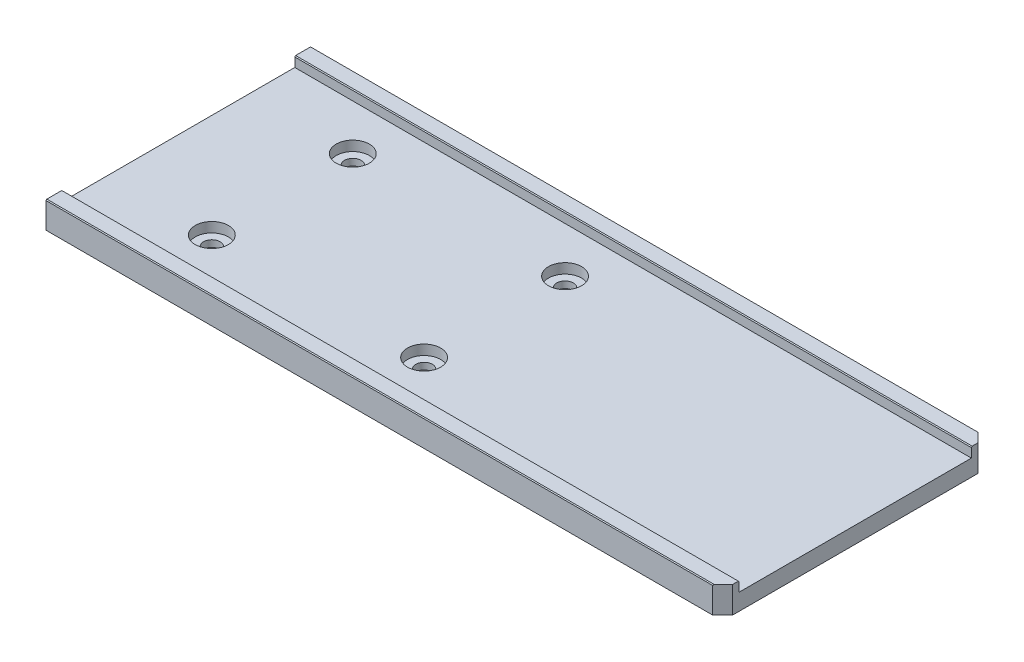
ISO-10303-21;
HEADER;
FILE_DESCRIPTION(('STEP AP214'),'2;1');
FILE_NAME('part.step','',(''),(''),'','','');
FILE_SCHEMA(('AUTOMOTIVE_DESIGN { 1 0 10303 214 1 1 1 1 }'));
ENDSEC;
DATA;
#1=APPLICATION_CONTEXT('core data for automotive mechanical design processes');
#2=APPLICATION_PROTOCOL_DEFINITION('international standard','automotive_design',2000,#1);
#3=PRODUCT_CONTEXT('',#1,'mechanical');
#4=PRODUCT('Part','Part','',(#3));
#5=PRODUCT_RELATED_PRODUCT_CATEGORY('part','',(#4));
#6=PRODUCT_DEFINITION_FORMATION('','',#4);
#7=PRODUCT_DEFINITION_CONTEXT('part definition',#1,'design');
#8=PRODUCT_DEFINITION('design','',#6,#7);
#9=PRODUCT_DEFINITION_SHAPE('','',#8);
#10=(LENGTH_UNIT() NAMED_UNIT(*) SI_UNIT(.MILLI.,.METRE.));
#11=(NAMED_UNIT(*) PLANE_ANGLE_UNIT() SI_UNIT($,.RADIAN.));
#12=(NAMED_UNIT(*) SI_UNIT($,.STERADIAN.) SOLID_ANGLE_UNIT());
#13=UNCERTAINTY_MEASURE_WITH_UNIT(LENGTH_MEASURE(1.E-05),#10,'distance_accuracy_value','');
#14=(GEOMETRIC_REPRESENTATION_CONTEXT(3) GLOBAL_UNCERTAINTY_ASSIGNED_CONTEXT((#13)) GLOBAL_UNIT_ASSIGNED_CONTEXT((#10,
#11,#12)) REPRESENTATION_CONTEXT('',''));
#15=CARTESIAN_POINT('',(0.,0.,0.));
#16=DIRECTION('',(0.,0.,1.));
#17=DIRECTION('',(1.,0.,0.));
#18=AXIS2_PLACEMENT_3D('',#15,#16,#17);
#19=CARTESIAN_POINT('',(0.,8.,0.));
#20=DIRECTION('',(0.,-1.,0.));
#21=DIRECTION('',(0.,0.,-1.));
#22=AXIS2_PLACEMENT_3D('',#19,#20,#21);
#23=PLANE('',#22);
#24=DIRECTION('',(0.,0.,1.));
#25=VECTOR('',#24,1.);
#26=CARTESIAN_POINT('',(0.,8.,0.));
#27=LINE('',#26,#25);
#28=CARTESIAN_POINT('',(0.,8.,-79.75));
#29=VERTEX_POINT('',#28);
#30=CARTESIAN_POINT('',(0.,8.,-75.25));
#31=VERTEX_POINT('',#30);
#32=EDGE_CURVE('E176',#29,#31,#27,.T.);
#33=ORIENTED_EDGE('',*,*,#32,.T.);
#34=DIRECTION('',(1.,0.,0.));
#35=VECTOR('',#34,1.);
#36=CARTESIAN_POINT('',(0.,8.,-75.25));
#37=LINE('',#36,#35);
#38=CARTESIAN_POINT('',(204.,8.,-75.25));
#39=VERTEX_POINT('',#38);
#40=EDGE_CURVE('E230',#31,#39,#37,.T.);
#41=ORIENTED_EDGE('',*,*,#40,.T.);
#42=DIRECTION('',(0.,0.,-1.));
#43=VECTOR('',#42,1.);
#44=CARTESIAN_POINT('',(204.,8.,0.));
#45=LINE('',#44,#43);
#46=CARTESIAN_POINT('',(204.,8.,-77.));
#47=VERTEX_POINT('',#46);
#48=EDGE_CURVE('E182',#39,#47,#45,.T.);
#49=ORIENTED_EDGE('',*,*,#48,.T.);
#50=DIRECTION('',(0.707106781186551,0.,0.707106781186544));
#51=VECTOR('',#50,1.);
#52=CARTESIAN_POINT('',(201.,8.,-80.));
#53=LINE('',#52,#51);
#54=CARTESIAN_POINT('',(201.25,8.,-79.75));
#55=VERTEX_POINT('',#54);
#56=EDGE_CURVE('E210',#47,#55,#53,.F.);
#57=ORIENTED_EDGE('',*,*,#56,.T.);
#58=DIRECTION('',(-1.,0.,0.));
#59=VECTOR('',#58,1.);
#60=CARTESIAN_POINT('',(0.,8.,-79.75));
#61=LINE('',#60,#59);
#62=EDGE_CURVE('E227',#55,#29,#61,.T.);
#63=ORIENTED_EDGE('',*,*,#62,.T.);
#64=EDGE_LOOP('',(#33,#41,#49,#57,#63));
#65=FACE_BOUND('',#64,.T.);
#66=ADVANCED_FACE('F39',(#65),#23,.F.);
#67=CARTESIAN_POINT('',(0.,8.,0.));
#68=DIRECTION('',(1.,0.,0.));
#69=DIRECTION('',(0.,0.,-1.));
#70=AXIS2_PLACEMENT_3D('',#67,#68,#69);
#71=PLANE('',#70);
#72=DIRECTION('',(0.,1.,0.));
#73=VECTOR('',#72,1.);
#74=CARTESIAN_POINT('',(0.,5.,-75.));
#75=LINE('',#74,#73);
#76=CARTESIAN_POINT('',(0.,5.,-75.));
#77=VERTEX_POINT('',#76);
#78=CARTESIAN_POINT('',(0.,7.75000000000003,-75.));
#79=VERTEX_POINT('',#78);
#80=EDGE_CURVE('E187',#77,#79,#75,.T.);
#81=ORIENTED_EDGE('',*,*,#80,.T.);
#82=DIRECTION('',(0.,-0.707106781186548,0.707106781186548));
#83=VECTOR('',#82,1.);
#84=CARTESIAN_POINT('',(0.,7.75000000000003,-75.));
#85=LINE('',#84,#83);
#86=EDGE_CURVE('E225',#79,#31,#85,.F.);
#87=ORIENTED_EDGE('',*,*,#86,.T.);
#88=ORIENTED_EDGE('',*,*,#32,.F.);
#89=DIRECTION('',(0.,0.707106781186508,0.707106781186587));
#90=VECTOR('',#89,1.);
#91=CARTESIAN_POINT('',(0.,8.,-79.75));
#92=LINE('',#91,#90);
#93=CARTESIAN_POINT('',(0.,7.75,-80.));
#94=VERTEX_POINT('',#93);
#95=EDGE_CURVE('E223',#29,#94,#92,.F.);
#96=ORIENTED_EDGE('',*,*,#95,.T.);
#97=DIRECTION('',(0.,-1.,0.));
#98=VECTOR('',#97,1.);
#99=CARTESIAN_POINT('',(0.,8.,-80.));
#100=LINE('',#99,#98);
#101=CARTESIAN_POINT('',(0.,0.,-80.));
#102=VERTEX_POINT('',#101);
#103=EDGE_CURVE('E181',#94,#102,#100,.T.);
#104=ORIENTED_EDGE('',*,*,#103,.T.);
#105=DIRECTION('',(0.,0.,1.));
#106=VECTOR('',#105,1.);
#107=CARTESIAN_POINT('',(0.,0.,0.));
#108=LINE('',#107,#106);
#109=CARTESIAN_POINT('',(0.,0.,0.));
#110=VERTEX_POINT('',#109);
#111=EDGE_CURVE('E183',#102,#110,#108,.T.);
#112=ORIENTED_EDGE('',*,*,#111,.T.);
#113=DIRECTION('',(0.,-1.,0.));
#114=VECTOR('',#113,1.);
#115=CARTESIAN_POINT('',(0.,8.,0.));
#116=LINE('',#115,#114);
#117=CARTESIAN_POINT('',(0.,7.75,0.));
#118=VERTEX_POINT('',#117);
#119=EDGE_CURVE('E196',#118,#110,#116,.T.);
#120=ORIENTED_EDGE('',*,*,#119,.F.);
#121=DIRECTION('',(0.,-0.707106781186548,0.707106781186548));
#122=VECTOR('',#121,1.);
#123=CARTESIAN_POINT('',(0.,8.,-0.25));
#124=LINE('',#123,#122);
#125=CARTESIAN_POINT('',(0.,8.,-0.25));
#126=VERTEX_POINT('',#125);
#127=EDGE_CURVE('E220',#118,#126,#124,.F.);
#128=ORIENTED_EDGE('',*,*,#127,.T.);
#129=CARTESIAN_POINT('',(0.,8.,-4.75));
#130=VERTEX_POINT('',#129);
#131=EDGE_CURVE('E173',#130,#126,#27,.T.);
#132=ORIENTED_EDGE('',*,*,#131,.F.);
#133=DIRECTION('',(0.,0.707106781186548,0.707106781186548));
#134=VECTOR('',#133,1.);
#135=CARTESIAN_POINT('',(0.,7.75,-5.));
#136=LINE('',#135,#134);
#137=CARTESIAN_POINT('',(0.,7.75,-5.));
#138=VERTEX_POINT('',#137);
#139=EDGE_CURVE('E166',#130,#138,#136,.F.);
#140=ORIENTED_EDGE('',*,*,#139,.T.);
#141=DIRECTION('',(0.,1.,0.));
#142=VECTOR('',#141,1.);
#143=CARTESIAN_POINT('',(0.,5.,-5.));
#144=LINE('',#143,#142);
#145=CARTESIAN_POINT('',(0.,5.,-5.));
#146=VERTEX_POINT('',#145);
#147=EDGE_CURVE('E145',#146,#138,#144,.T.);
#148=ORIENTED_EDGE('',*,*,#147,.F.);
#149=DIRECTION('',(0.,0.,1.));
#150=VECTOR('',#149,1.);
#151=CARTESIAN_POINT('',(0.,5.,-75.));
#152=LINE('',#151,#150);
#153=EDGE_CURVE('E152',#77,#146,#152,.T.);
#154=ORIENTED_EDGE('',*,*,#153,.F.);
#155=EDGE_LOOP('',(#81,#87,#88,#96,#104,#112,#120,#128,#132,#140,#148,#154));
#156=FACE_BOUND('',#155,.T.);
#157=ADVANCED_FACE('F163',(#156),#71,.F.);
#158=CARTESIAN_POINT('',(0.,8.,0.));
#159=DIRECTION('',(0.,0.,-1.));
#160=DIRECTION('',(-1.,0.,0.));
#161=AXIS2_PLACEMENT_3D('',#158,#159,#160);
#162=PLANE('',#161);
#163=DIRECTION('',(0.,1.,0.));
#164=VECTOR('',#163,1.);
#165=CARTESIAN_POINT('',(201.,8.,0.));
#166=LINE('',#165,#164);
#167=CARTESIAN_POINT('',(201.,0.,0.));
#168=VERTEX_POINT('',#167);
#169=CARTESIAN_POINT('',(201.,7.75,0.));
#170=VERTEX_POINT('',#169);
#171=EDGE_CURVE('E213',#168,#170,#166,.T.);
#172=ORIENTED_EDGE('',*,*,#171,.T.);
#173=DIRECTION('',(-1.,0.,0.));
#174=VECTOR('',#173,1.);
#175=CARTESIAN_POINT('',(0.,7.75,0.));
#176=LINE('',#175,#174);
#177=EDGE_CURVE('E11',#170,#118,#176,.T.);
#178=ORIENTED_EDGE('',*,*,#177,.T.);
#179=ORIENTED_EDGE('',*,*,#119,.T.);
#180=DIRECTION('',(1.,0.,0.));
#181=VECTOR('',#180,1.);
#182=CARTESIAN_POINT('',(0.,0.,0.));
#183=LINE('',#182,#181);
#184=EDGE_CURVE('E186',#110,#168,#183,.T.);
#185=ORIENTED_EDGE('',*,*,#184,.T.);
#186=EDGE_LOOP('',(#172,#178,#179,#185));
#187=FACE_BOUND('',#186,.T.);
#188=ADVANCED_FACE('F293',(#187),#162,.F.);
#189=CARTESIAN_POINT('',(204.,8.,0.));
#190=DIRECTION('',(-1.,0.,0.));
#191=DIRECTION('',(0.,0.,1.));
#192=AXIS2_PLACEMENT_3D('',#189,#190,#191);
#193=PLANE('',#192);
#194=ORIENTED_EDGE('',*,*,#48,.F.);
#195=DIRECTION('',(0.,0.707106781186548,-0.707106781186548));
#196=VECTOR('',#195,1.);
#197=CARTESIAN_POINT('',(204.,7.75000000000003,-75.));
#198=LINE('',#197,#196);
#199=CARTESIAN_POINT('',(204.,7.75000000000003,-75.));
#200=VERTEX_POINT('',#199);
#201=EDGE_CURVE('E234',#39,#200,#198,.F.);
#202=ORIENTED_EDGE('',*,*,#201,.T.);
#203=DIRECTION('',(0.,1.,0.));
#204=VECTOR('',#203,1.);
#205=CARTESIAN_POINT('',(204.,5.,-75.));
#206=LINE('',#205,#204);
#207=CARTESIAN_POINT('',(204.,5.,-75.));
#208=VERTEX_POINT('',#207);
#209=EDGE_CURVE('E168',#208,#200,#206,.T.);
#210=ORIENTED_EDGE('',*,*,#209,.F.);
#211=DIRECTION('',(0.,0.,-1.));
#212=VECTOR('',#211,1.);
#213=CARTESIAN_POINT('',(204.,5.,-75.));
#214=LINE('',#213,#212);
#215=CARTESIAN_POINT('',(204.,5.,-5.));
#216=VERTEX_POINT('',#215);
#217=EDGE_CURVE('E151',#216,#208,#214,.T.);
#218=ORIENTED_EDGE('',*,*,#217,.F.);
#219=DIRECTION('',(0.,1.,0.));
#220=VECTOR('',#219,1.);
#221=CARTESIAN_POINT('',(204.,5.,-5.));
#222=LINE('',#221,#220);
#223=CARTESIAN_POINT('',(204.,7.75,-5.));
#224=VERTEX_POINT('',#223);
#225=EDGE_CURVE('E148',#216,#224,#222,.T.);
#226=ORIENTED_EDGE('',*,*,#225,.T.);
#227=DIRECTION('',(0.,-0.707106781186548,-0.707106781186548));
#228=VECTOR('',#227,1.);
#229=CARTESIAN_POINT('',(204.,7.75,-5.));
#230=LINE('',#229,#228);
#231=CARTESIAN_POINT('',(204.,8.,-4.75));
#232=VERTEX_POINT('',#231);
#233=EDGE_CURVE('E232',#224,#232,#230,.F.);
#234=ORIENTED_EDGE('',*,*,#233,.T.);
#235=CARTESIAN_POINT('',(204.,8.,-2.99999999999998));
#236=VERTEX_POINT('',#235);
#237=EDGE_CURVE('E178',#236,#232,#45,.T.);
#238=ORIENTED_EDGE('',*,*,#237,.F.);
#239=DIRECTION('',(0.,-1.,0.));
#240=VECTOR('',#239,1.);
#241=CARTESIAN_POINT('',(204.,8.,-2.99999999999998));
#242=LINE('',#241,#240);
#243=CARTESIAN_POINT('',(204.,0.,-2.99999999999998));
#244=VERTEX_POINT('',#243);
#245=EDGE_CURVE('E204',#236,#244,#242,.T.);
#246=ORIENTED_EDGE('',*,*,#245,.T.);
#247=DIRECTION('',(0.,0.,-1.));
#248=VECTOR('',#247,1.);
#249=CARTESIAN_POINT('',(204.,0.,0.));
#250=LINE('',#249,#248);
#251=CARTESIAN_POINT('',(204.,0.,-77.));
#252=VERTEX_POINT('',#251);
#253=EDGE_CURVE('E190',#244,#252,#250,.T.);
#254=ORIENTED_EDGE('',*,*,#253,.T.);
#255=DIRECTION('',(0.,1.,0.));
#256=VECTOR('',#255,1.);
#257=CARTESIAN_POINT('',(204.,8.,-77.));
#258=LINE('',#257,#256);
#259=EDGE_CURVE('E207',#252,#47,#258,.T.);
#260=ORIENTED_EDGE('',*,*,#259,.T.);
#261=EDGE_LOOP('',(#194,#202,#210,#218,#226,#234,#238,#246,#254,#260));
#262=FACE_BOUND('',#261,.T.);
#263=ADVANCED_FACE('F255',(#262),#193,.F.);
#264=CARTESIAN_POINT('',(0.,8.,-80.));
#265=DIRECTION('',(0.,0.,1.));
#266=DIRECTION('',(1.,0.,0.));
#267=AXIS2_PLACEMENT_3D('',#264,#265,#266);
#268=PLANE('',#267);
#269=ORIENTED_EDGE('',*,*,#103,.F.);
#270=DIRECTION('',(1.,0.,0.));
#271=VECTOR('',#270,1.);
#272=CARTESIAN_POINT('',(0.,7.75,-80.));
#273=LINE('',#272,#271);
#274=CARTESIAN_POINT('',(201.,7.75,-80.));
#275=VERTEX_POINT('',#274);
#276=EDGE_CURVE('E236',#94,#275,#273,.T.);
#277=ORIENTED_EDGE('',*,*,#276,.T.);
#278=DIRECTION('',(0.,-1.,0.));
#279=VECTOR('',#278,1.);
#280=CARTESIAN_POINT('',(201.,8.,-80.));
#281=LINE('',#280,#279);
#282=CARTESIAN_POINT('',(201.,0.,-80.));
#283=VERTEX_POINT('',#282);
#284=EDGE_CURVE('E198',#275,#283,#281,.T.);
#285=ORIENTED_EDGE('',*,*,#284,.T.);
#286=DIRECTION('',(-1.,0.,0.));
#287=VECTOR('',#286,1.);
#288=CARTESIAN_POINT('',(0.,0.,-80.));
#289=LINE('',#288,#287);
#290=EDGE_CURVE('E177',#283,#102,#289,.T.);
#291=ORIENTED_EDGE('',*,*,#290,.T.);
#292=EDGE_LOOP('',(#269,#277,#285,#291));
#293=FACE_BOUND('',#292,.T.);
#294=ADVANCED_FACE('F284',(#293),#268,.F.);
#295=ORIENTED_EDGE('',*,*,#237,.T.);
#296=DIRECTION('',(-1.,0.,0.));
#297=VECTOR('',#296,1.);
#298=CARTESIAN_POINT('',(0.,8.,-4.75));
#299=LINE('',#298,#297);
#300=EDGE_CURVE('E244',#232,#130,#299,.T.);
#301=ORIENTED_EDGE('',*,*,#300,.T.);
#302=ORIENTED_EDGE('',*,*,#131,.T.);
#303=DIRECTION('',(1.,0.,0.));
#304=VECTOR('',#303,1.);
#305=CARTESIAN_POINT('',(0.,8.,-0.25));
#306=LINE('',#305,#304);
#307=CARTESIAN_POINT('',(201.25,8.,-0.249999999999999));
#308=VERTEX_POINT('',#307);
#309=EDGE_CURVE('E242',#126,#308,#306,.T.);
#310=ORIENTED_EDGE('',*,*,#309,.T.);
#311=DIRECTION('',(-0.707106781186551,0.,0.707106781186544));
#312=VECTOR('',#311,1.);
#313=CARTESIAN_POINT('',(204.,8.,-2.99999999999998));
#314=LINE('',#313,#312);
#315=EDGE_CURVE('E215',#308,#236,#314,.F.);
#316=ORIENTED_EDGE('',*,*,#315,.T.);
#317=EDGE_LOOP('',(#295,#301,#302,#310,#316));
#318=FACE_BOUND('',#317,.T.);
#319=ADVANCED_FACE('F247',(#318),#23,.F.);
#320=CARTESIAN_POINT('',(0.,0.,0.));
#321=DIRECTION('',(0.,-1.,0.));
#322=DIRECTION('',(0.,0.,-1.));
#323=AXIS2_PLACEMENT_3D('',#320,#321,#322);
#324=PLANE('',#323);
#325=CARTESIAN_POINT('',(31.247103348727,0.,-18.75));
#326=DIRECTION('',(0.,1.,0.));
#327=DIRECTION('',(0.,0.,1.));
#328=AXIS2_PLACEMENT_3D('',#325,#326,#327);
#329=CIRCLE('',#328,2.5);
#330=CARTESIAN_POINT('',(31.247103348727,0.,-16.25));
#331=VERTEX_POINT('',#330);
#332=EDGE_CURVE('E617',#331,#331,#329,.T.);
#333=ORIENTED_EDGE('',*,*,#332,.T.);
#334=EDGE_LOOP('',(#333));
#335=FACE_BOUND('',#334,.T.);
#336=CARTESIAN_POINT('',(95.247103348727,0.,-18.75));
#337=DIRECTION('',(0.,1.,0.));
#338=DIRECTION('',(0.,0.,1.));
#339=AXIS2_PLACEMENT_3D('',#336,#337,#338);
#340=CIRCLE('',#339,2.50000000000001);
#341=CARTESIAN_POINT('',(95.247103348727,0.,-16.25));
#342=VERTEX_POINT('',#341);
#343=EDGE_CURVE('E621',#342,#342,#340,.T.);
#344=ORIENTED_EDGE('',*,*,#343,.T.);
#345=EDGE_LOOP('',(#344));
#346=FACE_BOUND('',#345,.T.);
#347=CARTESIAN_POINT('',(95.247103348727,0.,-61.25));
#348=DIRECTION('',(0.,1.,0.));
#349=DIRECTION('',(0.,0.,1.));
#350=AXIS2_PLACEMENT_3D('',#347,#348,#349);
#351=CIRCLE('',#350,2.50000000000001);
#352=CARTESIAN_POINT('',(95.247103348727,0.,-58.75));
#353=VERTEX_POINT('',#352);
#354=EDGE_CURVE('E680',#353,#353,#351,.T.);
#355=ORIENTED_EDGE('',*,*,#354,.T.);
#356=EDGE_LOOP('',(#355));
#357=FACE_BOUND('',#356,.T.);
#358=CARTESIAN_POINT('',(31.247103348727,0.,-61.25));
#359=DIRECTION('',(0.,1.,0.));
#360=DIRECTION('',(0.,0.,1.));
#361=AXIS2_PLACEMENT_3D('',#358,#359,#360);
#362=CIRCLE('',#361,2.5);
#363=CARTESIAN_POINT('',(31.247103348727,0.,-58.75));
#364=VERTEX_POINT('',#363);
#365=EDGE_CURVE('E629',#364,#364,#362,.T.);
#366=ORIENTED_EDGE('',*,*,#365,.T.);
#367=EDGE_LOOP('',(#366));
#368=FACE_BOUND('',#367,.T.);
#369=ORIENTED_EDGE('',*,*,#290,.F.);
#370=DIRECTION('',(-0.707106781186551,0.,-0.707106781186544));
#371=VECTOR('',#370,1.);
#372=CARTESIAN_POINT('',(140.499999999999,0.,-140.5));
#373=LINE('',#372,#371);
#374=EDGE_CURVE('E202',#283,#252,#373,.F.);
#375=ORIENTED_EDGE('',*,*,#374,.T.);
#376=ORIENTED_EDGE('',*,*,#253,.F.);
#377=DIRECTION('',(0.707106781186551,0.,-0.707106781186544));
#378=VECTOR('',#377,1.);
#379=CARTESIAN_POINT('',(100.499999999999,0.,100.5));
#380=LINE('',#379,#378);
#381=EDGE_CURVE('E200',#244,#168,#380,.F.);
#382=ORIENTED_EDGE('',*,*,#381,.T.);
#383=ORIENTED_EDGE('',*,*,#184,.F.);
#384=ORIENTED_EDGE('',*,*,#111,.F.);
#385=EDGE_LOOP('',(#369,#375,#376,#382,#383,#384));
#386=FACE_BOUND('',#385,.T.);
#387=ADVANCED_FACE('F289',(#335,#346,#357,#368,#386),#324,.T.);
#388=CARTESIAN_POINT('',(0.,5.,-75.));
#389=DIRECTION('',(0.,0.,-1.));
#390=DIRECTION('',(-1.,0.,0.));
#391=AXIS2_PLACEMENT_3D('',#388,#389,#390);
#392=PLANE('',#391);
#393=ORIENTED_EDGE('',*,*,#209,.T.);
#394=DIRECTION('',(-1.,0.,0.));
#395=VECTOR('',#394,1.);
#396=CARTESIAN_POINT('',(0.,7.75000000000003,-75.));
#397=LINE('',#396,#395);
#398=EDGE_CURVE('E217',#200,#79,#397,.T.);
#399=ORIENTED_EDGE('',*,*,#398,.T.);
#400=ORIENTED_EDGE('',*,*,#80,.F.);
#401=DIRECTION('',(-1.,0.,0.));
#402=VECTOR('',#401,1.);
#403=CARTESIAN_POINT('',(0.,5.,-75.));
#404=LINE('',#403,#402);
#405=EDGE_CURVE('E158',#208,#77,#404,.T.);
#406=ORIENTED_EDGE('',*,*,#405,.F.);
#407=EDGE_LOOP('',(#393,#399,#400,#406));
#408=FACE_BOUND('',#407,.T.);
#409=ADVANCED_FACE('F262',(#408),#392,.F.);
#410=CARTESIAN_POINT('',(0.,5.,-5.));
#411=DIRECTION('',(0.,0.,1.));
#412=DIRECTION('',(1.,0.,0.));
#413=AXIS2_PLACEMENT_3D('',#410,#411,#412);
#414=PLANE('',#413);
#415=ORIENTED_EDGE('',*,*,#147,.T.);
#416=DIRECTION('',(1.,0.,0.));
#417=VECTOR('',#416,1.);
#418=CARTESIAN_POINT('',(0.,7.75,-5.));
#419=LINE('',#418,#417);
#420=EDGE_CURVE('E240',#138,#224,#419,.T.);
#421=ORIENTED_EDGE('',*,*,#420,.T.);
#422=ORIENTED_EDGE('',*,*,#225,.F.);
#423=DIRECTION('',(1.,0.,0.));
#424=VECTOR('',#423,1.);
#425=CARTESIAN_POINT('',(0.,5.,-5.));
#426=LINE('',#425,#424);
#427=EDGE_CURVE('E140',#146,#216,#426,.T.);
#428=ORIENTED_EDGE('',*,*,#427,.F.);
#429=EDGE_LOOP('',(#415,#421,#422,#428));
#430=FACE_BOUND('',#429,.T.);
#431=ADVANCED_FACE('F142',(#430),#414,.F.);
#432=CARTESIAN_POINT('',(0.,5.,0.));
#433=DIRECTION('',(0.,1.,0.));
#434=DIRECTION('',(0.,0.,1.));
#435=AXIS2_PLACEMENT_3D('',#432,#433,#434);
#436=PLANE('',#435);
#437=CARTESIAN_POINT('',(95.247103348727,5.,-61.25));
#438=DIRECTION('',(0.,1.,0.));
#439=DIRECTION('',(0.,0.,1.));
#440=AXIS2_PLACEMENT_3D('',#437,#438,#439);
#441=CIRCLE('',#440,4.99999999999999);
#442=CARTESIAN_POINT('',(95.247103348727,5.,-56.25));
#443=VERTEX_POINT('',#442);
#444=EDGE_CURVE('E643',#443,#443,#441,.T.);
#445=ORIENTED_EDGE('',*,*,#444,.F.);
#446=EDGE_LOOP('',(#445));
#447=FACE_BOUND('',#446,.T.);
#448=CARTESIAN_POINT('',(31.247103348727,5.,-18.75));
#449=DIRECTION('',(0.,1.,0.));
#450=DIRECTION('',(0.,0.,1.));
#451=AXIS2_PLACEMENT_3D('',#448,#449,#450);
#452=CIRCLE('',#451,5.);
#453=CARTESIAN_POINT('',(31.247103348727,5.,-13.75));
#454=VERTEX_POINT('',#453);
#455=EDGE_CURVE('E650',#454,#454,#452,.T.);
#456=ORIENTED_EDGE('',*,*,#455,.F.);
#457=EDGE_LOOP('',(#456));
#458=FACE_BOUND('',#457,.T.);
#459=CARTESIAN_POINT('',(95.247103348727,5.,-18.75));
#460=DIRECTION('',(0.,1.,0.));
#461=DIRECTION('',(0.,0.,1.));
#462=AXIS2_PLACEMENT_3D('',#459,#460,#461);
#463=CIRCLE('',#462,4.99999999999999);
#464=CARTESIAN_POINT('',(95.247103348727,5.,-13.75));
#465=VERTEX_POINT('',#464);
#466=EDGE_CURVE('E637',#465,#465,#463,.T.);
#467=ORIENTED_EDGE('',*,*,#466,.F.);
#468=EDGE_LOOP('',(#467));
#469=FACE_BOUND('',#468,.T.);
#470=CARTESIAN_POINT('',(31.247103348727,5.,-61.25));
#471=DIRECTION('',(0.,1.,0.));
#472=DIRECTION('',(0.,0.,1.));
#473=AXIS2_PLACEMENT_3D('',#470,#471,#472);
#474=CIRCLE('',#473,5.);
#475=CARTESIAN_POINT('',(31.247103348727,5.,-56.25));
#476=VERTEX_POINT('',#475);
#477=EDGE_CURVE('E646',#476,#476,#474,.T.);
#478=ORIENTED_EDGE('',*,*,#477,.F.);
#479=EDGE_LOOP('',(#478));
#480=FACE_BOUND('',#479,.T.);
#481=ORIENTED_EDGE('',*,*,#153,.T.);
#482=ORIENTED_EDGE('',*,*,#427,.T.);
#483=ORIENTED_EDGE('',*,*,#217,.T.);
#484=ORIENTED_EDGE('',*,*,#405,.T.);
#485=EDGE_LOOP('',(#481,#482,#483,#484));
#486=FACE_BOUND('',#485,.T.);
#487=ADVANCED_FACE('F156',(#447,#458,#469,#480,#486),#436,.T.);
#488=CARTESIAN_POINT('',(31.247103348727,2.,-61.25));
#489=DIRECTION('',(0.,1.,0.));
#490=DIRECTION('',(0.,0.,1.));
#491=AXIS2_PLACEMENT_3D('',#488,#489,#490);
#492=CYLINDRICAL_SURFACE('',#491,5.);
#493=CARTESIAN_POINT('',(31.247103348727,2.,-61.25));
#494=DIRECTION('',(0.,1.,0.));
#495=DIRECTION('',(0.,0.,1.));
#496=AXIS2_PLACEMENT_3D('',#493,#494,#495);
#497=CIRCLE('',#496,5.);
#498=CARTESIAN_POINT('',(31.247103348727,2.,-56.25));
#499=VERTEX_POINT('',#498);
#500=EDGE_CURVE('E161',#499,#499,#497,.T.);
#501=ORIENTED_EDGE('',*,*,#500,.F.);
#502=EDGE_LOOP('',(#501));
#503=FACE_BOUND('',#502,.T.);
#504=ORIENTED_EDGE('',*,*,#477,.T.);
#505=EDGE_LOOP('',(#504));
#506=FACE_BOUND('',#505,.T.);
#507=ADVANCED_FACE('F368',(#503,#506),#492,.F.);
#508=CARTESIAN_POINT('',(31.247103348727,2.,-61.25));
#509=DIRECTION('',(0.,1.,0.));
#510=DIRECTION('',(0.,0.,1.));
#511=AXIS2_PLACEMENT_3D('',#508,#509,#510);
#512=PLANE('',#511);
#513=CARTESIAN_POINT('',(31.247103348727,2.,-61.25));
#514=DIRECTION('',(0.,1.,0.));
#515=DIRECTION('',(0.,0.,1.));
#516=AXIS2_PLACEMENT_3D('',#513,#514,#515);
#517=CIRCLE('',#516,2.5);
#518=CARTESIAN_POINT('',(31.247103348727,2.,-58.75));
#519=VERTEX_POINT('',#518);
#520=EDGE_CURVE('E633',#519,#519,#517,.T.);
#521=ORIENTED_EDGE('',*,*,#520,.F.);
#522=EDGE_LOOP('',(#521));
#523=FACE_BOUND('',#522,.T.);
#524=ORIENTED_EDGE('',*,*,#500,.T.);
#525=EDGE_LOOP('',(#524));
#526=FACE_BOUND('',#525,.T.);
#527=ADVANCED_FACE('F378',(#523,#526),#512,.T.);
#528=CARTESIAN_POINT('',(95.247103348727,2.,-18.75));
#529=DIRECTION('',(0.,1.,0.));
#530=DIRECTION('',(0.,0.,1.));
#531=AXIS2_PLACEMENT_3D('',#528,#529,#530);
#532=CYLINDRICAL_SURFACE('',#531,4.99999999999999);
#533=CARTESIAN_POINT('',(95.247103348727,2.,-18.75));
#534=DIRECTION('',(0.,1.,0.));
#535=DIRECTION('',(0.,0.,1.));
#536=AXIS2_PLACEMENT_3D('',#533,#534,#535);
#537=CIRCLE('',#536,4.99999999999999);
#538=CARTESIAN_POINT('',(95.247103348727,2.,-13.75));
#539=VERTEX_POINT('',#538);
#540=EDGE_CURVE('E632',#539,#539,#537,.T.);
#541=ORIENTED_EDGE('',*,*,#540,.F.);
#542=EDGE_LOOP('',(#541));
#543=FACE_BOUND('',#542,.T.);
#544=ORIENTED_EDGE('',*,*,#466,.T.);
#545=EDGE_LOOP('',(#544));
#546=FACE_BOUND('',#545,.T.);
#547=ADVANCED_FACE('F388',(#543,#546),#532,.F.);
#548=CARTESIAN_POINT('',(95.247103348727,2.,-18.75));
#549=DIRECTION('',(0.,1.,0.));
#550=DIRECTION('',(0.,0.,1.));
#551=AXIS2_PLACEMENT_3D('',#548,#549,#550);
#552=PLANE('',#551);
#553=CARTESIAN_POINT('',(95.247103348727,2.,-18.75));
#554=DIRECTION('',(0.,1.,0.));
#555=DIRECTION('',(0.,0.,1.));
#556=AXIS2_PLACEMENT_3D('',#553,#554,#555);
#557=CIRCLE('',#556,2.50000000000001);
#558=CARTESIAN_POINT('',(95.247103348727,2.,-16.25));
#559=VERTEX_POINT('',#558);
#560=EDGE_CURVE('E624',#559,#559,#557,.T.);
#561=ORIENTED_EDGE('',*,*,#560,.F.);
#562=EDGE_LOOP('',(#561));
#563=FACE_BOUND('',#562,.T.);
#564=ORIENTED_EDGE('',*,*,#540,.T.);
#565=EDGE_LOOP('',(#564));
#566=FACE_BOUND('',#565,.T.);
#567=ADVANCED_FACE('F398',(#563,#566),#552,.T.);
#568=CARTESIAN_POINT('',(31.247103348727,2.,-18.75));
#569=DIRECTION('',(0.,1.,0.));
#570=DIRECTION('',(0.,0.,1.));
#571=AXIS2_PLACEMENT_3D('',#568,#569,#570);
#572=CYLINDRICAL_SURFACE('',#571,5.);
#573=CARTESIAN_POINT('',(31.247103348727,2.,-18.75));
#574=DIRECTION('',(0.,1.,0.));
#575=DIRECTION('',(0.,0.,1.));
#576=AXIS2_PLACEMENT_3D('',#573,#574,#575);
#577=CIRCLE('',#576,5.);
#578=CARTESIAN_POINT('',(31.247103348727,2.,-13.75));
#579=VERTEX_POINT('',#578);
#580=EDGE_CURVE('E640',#579,#579,#577,.T.);
#581=ORIENTED_EDGE('',*,*,#580,.F.);
#582=EDGE_LOOP('',(#581));
#583=FACE_BOUND('',#582,.T.);
#584=ORIENTED_EDGE('',*,*,#455,.T.);
#585=EDGE_LOOP('',(#584));
#586=FACE_BOUND('',#585,.T.);
#587=ADVANCED_FACE('F408',(#583,#586),#572,.F.);
#588=CARTESIAN_POINT('',(31.247103348727,2.,-18.75));
#589=DIRECTION('',(0.,1.,0.));
#590=DIRECTION('',(0.,0.,1.));
#591=AXIS2_PLACEMENT_3D('',#588,#589,#590);
#592=PLANE('',#591);
#593=CARTESIAN_POINT('',(31.247103348727,2.,-18.75));
#594=DIRECTION('',(0.,1.,0.));
#595=DIRECTION('',(0.,0.,1.));
#596=AXIS2_PLACEMENT_3D('',#593,#594,#595);
#597=CIRCLE('',#596,2.5);
#598=CARTESIAN_POINT('',(31.247103348727,2.,-16.25));
#599=VERTEX_POINT('',#598);
#600=EDGE_CURVE('E620',#599,#599,#597,.T.);
#601=ORIENTED_EDGE('',*,*,#600,.F.);
#602=EDGE_LOOP('',(#601));
#603=FACE_BOUND('',#602,.T.);
#604=ORIENTED_EDGE('',*,*,#580,.T.);
#605=EDGE_LOOP('',(#604));
#606=FACE_BOUND('',#605,.T.);
#607=ADVANCED_FACE('F418',(#603,#606),#592,.T.);
#608=CARTESIAN_POINT('',(95.247103348727,2.,-61.25));
#609=DIRECTION('',(0.,1.,0.));
#610=DIRECTION('',(0.,0.,1.));
#611=AXIS2_PLACEMENT_3D('',#608,#609,#610);
#612=CYLINDRICAL_SURFACE('',#611,4.99999999999999);
#613=CARTESIAN_POINT('',(95.247103348727,2.,-61.25));
#614=DIRECTION('',(0.,1.,0.));
#615=DIRECTION('',(0.,0.,1.));
#616=AXIS2_PLACEMENT_3D('',#613,#614,#615);
#617=CIRCLE('',#616,4.99999999999999);
#618=CARTESIAN_POINT('',(95.247103348727,2.,-56.25));
#619=VERTEX_POINT('',#618);
#620=EDGE_CURVE('E647',#619,#619,#617,.T.);
#621=ORIENTED_EDGE('',*,*,#620,.F.);
#622=EDGE_LOOP('',(#621));
#623=FACE_BOUND('',#622,.T.);
#624=ORIENTED_EDGE('',*,*,#444,.T.);
#625=EDGE_LOOP('',(#624));
#626=FACE_BOUND('',#625,.T.);
#627=ADVANCED_FACE('F428',(#623,#626),#612,.F.);
#628=CARTESIAN_POINT('',(95.247103348727,2.,-61.25));
#629=DIRECTION('',(0.,1.,0.));
#630=DIRECTION('',(0.,0.,1.));
#631=AXIS2_PLACEMENT_3D('',#628,#629,#630);
#632=PLANE('',#631);
#633=CARTESIAN_POINT('',(95.247103348727,2.,-61.25));
#634=DIRECTION('',(0.,1.,0.));
#635=DIRECTION('',(0.,0.,1.));
#636=AXIS2_PLACEMENT_3D('',#633,#634,#635);
#637=CIRCLE('',#636,2.50000000000001);
#638=CARTESIAN_POINT('',(95.247103348727,2.,-58.75));
#639=VERTEX_POINT('',#638);
#640=EDGE_CURVE('E636',#639,#639,#637,.T.);
#641=ORIENTED_EDGE('',*,*,#640,.F.);
#642=EDGE_LOOP('',(#641));
#643=FACE_BOUND('',#642,.T.);
#644=ORIENTED_EDGE('',*,*,#620,.T.);
#645=EDGE_LOOP('',(#644));
#646=FACE_BOUND('',#645,.T.);
#647=ADVANCED_FACE('F438',(#643,#646),#632,.T.);
#648=CARTESIAN_POINT('',(31.247103348727,0.,-61.25));
#649=DIRECTION('',(0.,1.,0.));
#650=DIRECTION('',(0.,0.,1.));
#651=AXIS2_PLACEMENT_3D('',#648,#649,#650);
#652=CYLINDRICAL_SURFACE('',#651,2.5);
#653=ORIENTED_EDGE('',*,*,#365,.F.);
#654=EDGE_LOOP('',(#653));
#655=FACE_BOUND('',#654,.T.);
#656=ORIENTED_EDGE('',*,*,#520,.T.);
#657=EDGE_LOOP('',(#656));
#658=FACE_BOUND('',#657,.T.);
#659=ADVANCED_FACE('F448',(#655,#658),#652,.F.);
#660=CARTESIAN_POINT('',(95.247103348727,0.,-61.25));
#661=DIRECTION('',(0.,1.,0.));
#662=DIRECTION('',(0.,0.,1.));
#663=AXIS2_PLACEMENT_3D('',#660,#661,#662);
#664=CYLINDRICAL_SURFACE('',#663,2.50000000000001);
#665=ORIENTED_EDGE('',*,*,#354,.F.);
#666=EDGE_LOOP('',(#665));
#667=FACE_BOUND('',#666,.T.);
#668=ORIENTED_EDGE('',*,*,#640,.T.);
#669=EDGE_LOOP('',(#668));
#670=FACE_BOUND('',#669,.T.);
#671=ADVANCED_FACE('F458',(#667,#670),#664,.F.);
#672=CARTESIAN_POINT('',(95.247103348727,0.,-18.75));
#673=DIRECTION('',(0.,1.,0.));
#674=DIRECTION('',(0.,0.,1.));
#675=AXIS2_PLACEMENT_3D('',#672,#673,#674);
#676=CYLINDRICAL_SURFACE('',#675,2.50000000000001);
#677=ORIENTED_EDGE('',*,*,#343,.F.);
#678=EDGE_LOOP('',(#677));
#679=FACE_BOUND('',#678,.T.);
#680=ORIENTED_EDGE('',*,*,#560,.T.);
#681=EDGE_LOOP('',(#680));
#682=FACE_BOUND('',#681,.T.);
#683=ADVANCED_FACE('F468',(#679,#682),#676,.F.);
#684=CARTESIAN_POINT('',(31.247103348727,0.,-18.75));
#685=DIRECTION('',(0.,1.,0.));
#686=DIRECTION('',(0.,0.,1.));
#687=AXIS2_PLACEMENT_3D('',#684,#685,#686);
#688=CYLINDRICAL_SURFACE('',#687,2.5);
#689=ORIENTED_EDGE('',*,*,#332,.F.);
#690=EDGE_LOOP('',(#689));
#691=FACE_BOUND('',#690,.T.);
#692=ORIENTED_EDGE('',*,*,#600,.T.);
#693=EDGE_LOOP('',(#692));
#694=FACE_BOUND('',#693,.T.);
#695=ADVANCED_FACE('F478',(#691,#694),#688,.F.);
#696=CARTESIAN_POINT('',(201.,8.,-80.));
#697=DIRECTION('',(-0.707106781186544,0.,0.707106781186551));
#698=DIRECTION('',(0.,-1.,0.));
#699=AXIS2_PLACEMENT_3D('',#696,#697,#698);
#700=PLANE('',#699);
#701=ORIENTED_EDGE('',*,*,#284,.F.);
#702=DIRECTION('',(0.577350269189651,0.577350269189581,0.577350269189645));
#703=VECTOR('',#702,1.);
#704=CARTESIAN_POINT('',(201.083333333333,7.83333333333332,-79.9166666666667));
#705=LINE('',#704,#703);
#706=EDGE_CURVE('E238',#275,#55,#705,.T.);
#707=ORIENTED_EDGE('',*,*,#706,.T.);
#708=ORIENTED_EDGE('',*,*,#56,.F.);
#709=ORIENTED_EDGE('',*,*,#259,.F.);
#710=ORIENTED_EDGE('',*,*,#374,.F.);
#711=EDGE_LOOP('',(#701,#707,#708,#709,#710));
#712=FACE_BOUND('',#711,.T.);
#713=ADVANCED_FACE('F277',(#712),#700,.F.);
#714=CARTESIAN_POINT('',(204.,8.,-2.99999999999998));
#715=DIRECTION('',(-0.707106781186544,0.,-0.707106781186551));
#716=DIRECTION('',(0.,-1.,0.));
#717=AXIS2_PLACEMENT_3D('',#714,#715,#716);
#718=PLANE('',#717);
#719=ORIENTED_EDGE('',*,*,#315,.F.);
#720=DIRECTION('',(-0.577350269189629,-0.577350269189624,0.577350269189624));
#721=VECTOR('',#720,1.);
#722=CARTESIAN_POINT('',(203.083333333333,9.83333333333332,-2.08333333333332));
#723=LINE('',#722,#721);
#724=EDGE_CURVE('E48',#308,#170,#723,.T.);
#725=ORIENTED_EDGE('',*,*,#724,.T.);
#726=ORIENTED_EDGE('',*,*,#171,.F.);
#727=ORIENTED_EDGE('',*,*,#381,.F.);
#728=ORIENTED_EDGE('',*,*,#245,.F.);
#729=EDGE_LOOP('',(#719,#725,#726,#727,#728));
#730=FACE_BOUND('',#729,.T.);
#731=ADVANCED_FACE('F292',(#730),#718,.F.);
#732=CARTESIAN_POINT('',(0.,7.75000000000003,-75.));
#733=DIRECTION('',(0.,-0.707106781186548,-0.707106781186548));
#734=DIRECTION('',(-1.,0.,0.));
#735=AXIS2_PLACEMENT_3D('',#732,#733,#734);
#736=PLANE('',#735);
#737=ORIENTED_EDGE('',*,*,#201,.F.);
#738=ORIENTED_EDGE('',*,*,#40,.F.);
#739=ORIENTED_EDGE('',*,*,#86,.F.);
#740=ORIENTED_EDGE('',*,*,#398,.F.);
#741=EDGE_LOOP('',(#737,#738,#739,#740));
#742=FACE_BOUND('',#741,.T.);
#743=ADVANCED_FACE('F265',(#742),#736,.F.);
#744=CARTESIAN_POINT('',(0.,8.,-79.75));
#745=DIRECTION('',(0.,-0.707106781186587,0.707106781186508));
#746=DIRECTION('',(-1.,0.,0.));
#747=AXIS2_PLACEMENT_3D('',#744,#745,#746);
#748=PLANE('',#747);
#749=ORIENTED_EDGE('',*,*,#706,.F.);
#750=ORIENTED_EDGE('',*,*,#276,.F.);
#751=ORIENTED_EDGE('',*,*,#95,.F.);
#752=ORIENTED_EDGE('',*,*,#62,.F.);
#753=EDGE_LOOP('',(#749,#750,#751,#752));
#754=FACE_BOUND('',#753,.T.);
#755=ADVANCED_FACE('F281',(#754),#748,.F.);
#756=CARTESIAN_POINT('',(0.,7.75,-5.));
#757=DIRECTION('',(0.,-0.707106781186547,0.707106781186547));
#758=DIRECTION('',(1.,0.,0.));
#759=AXIS2_PLACEMENT_3D('',#756,#757,#758);
#760=PLANE('',#759);
#761=ORIENTED_EDGE('',*,*,#139,.F.);
#762=ORIENTED_EDGE('',*,*,#300,.F.);
#763=ORIENTED_EDGE('',*,*,#233,.F.);
#764=ORIENTED_EDGE('',*,*,#420,.F.);
#765=EDGE_LOOP('',(#761,#762,#763,#764));
#766=FACE_BOUND('',#765,.T.);
#767=ADVANCED_FACE('F252',(#766),#760,.F.);
#768=CARTESIAN_POINT('',(0.,8.,-0.25));
#769=DIRECTION('',(0.,-0.707106781186547,-0.707106781186547));
#770=DIRECTION('',(1.,0.,0.));
#771=AXIS2_PLACEMENT_3D('',#768,#769,#770);
#772=PLANE('',#771);
#773=ORIENTED_EDGE('',*,*,#127,.F.);
#774=ORIENTED_EDGE('',*,*,#177,.F.);
#775=ORIENTED_EDGE('',*,*,#724,.F.);
#776=ORIENTED_EDGE('',*,*,#309,.F.);
#777=EDGE_LOOP('',(#773,#774,#775,#776));
#778=FACE_BOUND('',#777,.T.);
#779=ADVANCED_FACE('F42',(#778),#772,.F.);
#780=CLOSED_SHELL('',(#66,#157,#188,#263,#294,#319,#387,#409,#431,#487,#507,#527,#547,#567,#587,
#607,#627,#647,#659,#671,#683,#695,#713,#731,#743,#755,#767,#779));
#781=MANIFOLD_SOLID_BREP('B2',#780);
#782=ADVANCED_BREP_SHAPE_REPRESENTATION('',(#18,#781),#14);
#783=SHAPE_DEFINITION_REPRESENTATION(#9,#782);
ENDSEC;
END-ISO-10303-21;
